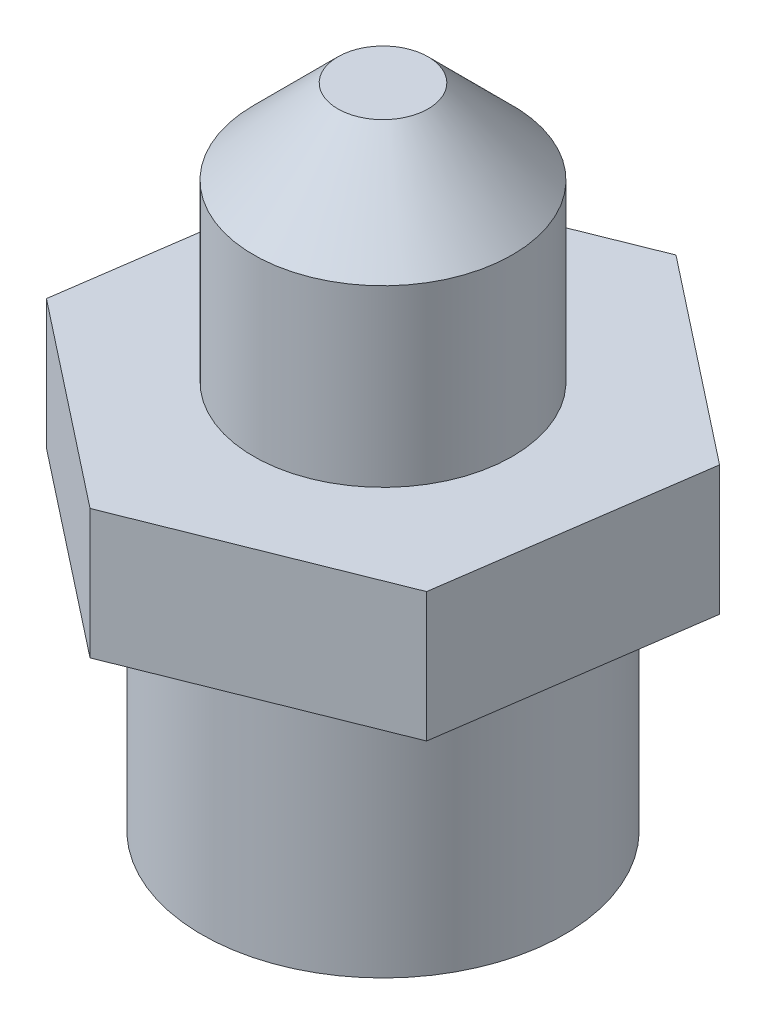
ISO-10303-21;
HEADER;
FILE_DESCRIPTION(('STEP AP214'),'2;1');
FILE_NAME('part.step','',(''),(''),'','','');
FILE_SCHEMA(('AUTOMOTIVE_DESIGN { 1 0 10303 214 1 1 1 1 }'));
ENDSEC;
DATA;
#1=APPLICATION_CONTEXT('core data for automotive mechanical design processes');
#2=APPLICATION_PROTOCOL_DEFINITION('international standard','automotive_design',2000,#1);
#3=PRODUCT_CONTEXT('',#1,'mechanical');
#4=PRODUCT('Part','Part','',(#3));
#5=PRODUCT_RELATED_PRODUCT_CATEGORY('part','',(#4));
#6=PRODUCT_DEFINITION_FORMATION('','',#4);
#7=PRODUCT_DEFINITION_CONTEXT('part definition',#1,'design');
#8=PRODUCT_DEFINITION('design','',#6,#7);
#9=PRODUCT_DEFINITION_SHAPE('','',#8);
#10=(LENGTH_UNIT() NAMED_UNIT(*) SI_UNIT(.MILLI.,.METRE.));
#11=(NAMED_UNIT(*) PLANE_ANGLE_UNIT() SI_UNIT($,.RADIAN.));
#12=(NAMED_UNIT(*) SI_UNIT($,.STERADIAN.) SOLID_ANGLE_UNIT());
#13=UNCERTAINTY_MEASURE_WITH_UNIT(LENGTH_MEASURE(1.E-05),#10,'distance_accuracy_value','');
#14=(GEOMETRIC_REPRESENTATION_CONTEXT(3) GLOBAL_UNCERTAINTY_ASSIGNED_CONTEXT((#13)) GLOBAL_UNIT_ASSIGNED_CONTEXT((#10,
#11,#12)) REPRESENTATION_CONTEXT('',''));
#15=CARTESIAN_POINT('',(0.,0.,0.));
#16=DIRECTION('',(0.,0.,1.));
#17=DIRECTION('',(1.,0.,0.));
#18=AXIS2_PLACEMENT_3D('',#15,#16,#17);
#19=CARTESIAN_POINT('',(10.,15.,0.));
#20=DIRECTION('',(0.,-1.,0.));
#21=DIRECTION('',(1.,0.,0.));
#22=AXIS2_PLACEMENT_3D('',#19,#20,#21);
#23=PLANE('',#22);
#24=CARTESIAN_POINT('',(0.,15.,0.));
#25=DIRECTION('',(0.,1.,0.));
#26=DIRECTION('',(-1.,0.,0.));
#27=AXIS2_PLACEMENT_3D('',#24,#25,#26);
#28=CIRCLE('',#27,5.);
#29=CARTESIAN_POINT('',(-5.,15.,0.));
#30=VERTEX_POINT('',#29);
#31=EDGE_CURVE('E143',#30,#30,#28,.T.);
#32=ORIENTED_EDGE('',*,*,#31,.F.);
#33=EDGE_LOOP('',(#32));
#34=FACE_BOUND('',#33,.T.);
#35=DIRECTION('',(0.928236965949758,0.,-0.371989428672897));
#36=VECTOR('',#35,1.);
#37=CARTESIAN_POINT('',(-1.41966187804891,15.,9.89871507580729));
#38=LINE('',#37,#36);
#39=CARTESIAN_POINT('',(-1.41966187804891,15.,9.89871507580729));
#40=VERTEX_POINT('',#39);
#41=CARTESIAN_POINT('',(7.86270778144867,15.,6.17882078907833));
#42=VERTEX_POINT('',#41);
#43=EDGE_CURVE('E111',#40,#42,#38,.T.);
#44=ORIENTED_EDGE('',*,*,#43,.T.);
#45=DIRECTION('',(0.141966187804891,0.,-0.98987150758073));
#46=VECTOR('',#45,1.);
#47=CARTESIAN_POINT('',(7.86270778144867,15.,6.17882078907833));
#48=LINE('',#47,#46);
#49=CARTESIAN_POINT('',(9.28236965949758,15.,-3.71989428672898));
#50=VERTEX_POINT('',#49);
#51=EDGE_CURVE('E109',#42,#50,#48,.T.);
#52=ORIENTED_EDGE('',*,*,#51,.T.);
#53=DIRECTION('',(-0.786270778144867,0.,-0.617882078907833));
#54=VECTOR('',#53,1.);
#55=CARTESIAN_POINT('',(9.28236965949757,15.,-3.71989428672897));
#56=LINE('',#55,#54);
#57=CARTESIAN_POINT('',(1.41966187804891,15.,-9.89871507580729));
#58=VERTEX_POINT('',#57);
#59=EDGE_CURVE('E59',#50,#58,#56,.T.);
#60=ORIENTED_EDGE('',*,*,#59,.T.);
#61=DIRECTION('',(-0.928236965949758,0.,0.371989428672897));
#62=VECTOR('',#61,1.);
#63=CARTESIAN_POINT('',(1.41966187804891,15.,-9.89871507580729));
#64=LINE('',#63,#62);
#65=CARTESIAN_POINT('',(-7.86270778144866,15.,-6.17882078907833));
#66=VERTEX_POINT('',#65);
#67=EDGE_CURVE('E99',#58,#66,#64,.T.);
#68=ORIENTED_EDGE('',*,*,#67,.T.);
#69=DIRECTION('',(-0.141966187804891,0.,0.98987150758073));
#70=VECTOR('',#69,1.);
#71=CARTESIAN_POINT('',(-7.86270778144866,15.,-6.17882078907833));
#72=LINE('',#71,#70);
#73=CARTESIAN_POINT('',(-9.28236965949757,15.,3.71989428672897));
#74=VERTEX_POINT('',#73);
#75=EDGE_CURVE('E105',#66,#74,#72,.T.);
#76=ORIENTED_EDGE('',*,*,#75,.T.);
#77=DIRECTION('',(0.786270778144867,0.,0.617882078907833));
#78=VECTOR('',#77,1.);
#79=CARTESIAN_POINT('',(-9.28236965949757,15.,3.71989428672897));
#80=LINE('',#79,#78);
#81=EDGE_CURVE('E116',#74,#40,#80,.T.);
#82=ORIENTED_EDGE('',*,*,#81,.T.);
#83=EDGE_LOOP('',(#44,#52,#60,#68,#76,#82));
#84=FACE_BOUND('',#83,.T.);
#85=ADVANCED_FACE('F36',(#34,#84),#23,.F.);
#86=CARTESIAN_POINT('',(0.,25.,0.));
#87=DIRECTION('',(0.,1.,0.));
#88=DIRECTION('',(-1.,0.,0.));
#89=AXIS2_PLACEMENT_3D('',#86,#87,#88);
#90=CYLINDRICAL_SURFACE('',#89,5.);
#91=CARTESIAN_POINT('',(0.,21.7441860465116,0.));
#92=DIRECTION('',(0.,1.,0.));
#93=DIRECTION('',(-1.,0.,0.));
#94=AXIS2_PLACEMENT_3D('',#91,#92,#93);
#95=CIRCLE('',#94,5.);
#96=CARTESIAN_POINT('',(-5.,21.7441860465116,0.));
#97=VERTEX_POINT('',#96);
#98=EDGE_CURVE('E140',#97,#97,#95,.T.);
#99=ORIENTED_EDGE('',*,*,#98,.F.);
#100=EDGE_LOOP('',(#99));
#101=FACE_BOUND('',#100,.T.);
#102=ORIENTED_EDGE('',*,*,#31,.T.);
#103=EDGE_LOOP('',(#102));
#104=FACE_BOUND('',#103,.T.);
#105=ADVANCED_FACE('F163',(#101,#104),#90,.T.);
#106=CARTESIAN_POINT('',(0.,21.7441860465116,0.));
#107=DIRECTION('',(0.,-1.,0.));
#108=DIRECTION('',(1.,0.,0.));
#109=AXIS2_PLACEMENT_3D('',#106,#107,#108);
#110=CONICAL_SURFACE('',#109,5.,0.785398163397449);
#111=CARTESIAN_POINT('',(0.,25.,0.));
#112=DIRECTION('',(0.,1.,0.));
#113=DIRECTION('',(-1.,0.,0.));
#114=AXIS2_PLACEMENT_3D('',#111,#112,#113);
#115=CIRCLE('',#114,1.74418604651164);
#116=CARTESIAN_POINT('',(-1.74418604651164,25.,0.));
#117=VERTEX_POINT('',#116);
#118=EDGE_CURVE('E137',#117,#117,#115,.T.);
#119=ORIENTED_EDGE('',*,*,#118,.F.);
#120=EDGE_LOOP('',(#119));
#121=FACE_BOUND('',#120,.T.);
#122=ORIENTED_EDGE('',*,*,#98,.T.);
#123=EDGE_LOOP('',(#122));
#124=FACE_BOUND('',#123,.T.);
#125=ADVANCED_FACE('F169',(#121,#124),#110,.T.);
#126=CARTESIAN_POINT('',(1.74418604651164,25.,0.));
#127=DIRECTION('',(0.,-1.,0.));
#128=DIRECTION('',(1.,0.,0.));
#129=AXIS2_PLACEMENT_3D('',#126,#127,#128);
#130=PLANE('',#129);
#131=ORIENTED_EDGE('',*,*,#118,.T.);
#132=EDGE_LOOP('',(#131));
#133=FACE_BOUND('',#132,.T.);
#134=ADVANCED_FACE('F200',(#133),#130,.F.);
#135=CARTESIAN_POINT('',(-1.41966187804891,0.,9.89871507580729));
#136=DIRECTION('',(0.371989428672897,0.,0.928236965949758));
#137=DIRECTION('',(0.928236965949758,0.,-0.371989428672897));
#138=AXIS2_PLACEMENT_3D('',#135,#136,#137);
#139=PLANE('',#138);
#140=DIRECTION('',(0.928236965949758,0.,-0.371989428672897));
#141=VECTOR('',#140,1.);
#142=CARTESIAN_POINT('',(9.25289000638916,10.,5.62170756198582));
#143=LINE('',#142,#141);
#144=CARTESIAN_POINT('',(-1.41966187804891,10.,9.89871507580729));
#145=VERTEX_POINT('',#144);
#146=CARTESIAN_POINT('',(7.86270778144866,10.,6.17882078907834));
#147=VERTEX_POINT('',#146);
#148=EDGE_CURVE('E135',#145,#147,#143,.T.);
#149=ORIENTED_EDGE('',*,*,#148,.T.);
#150=DIRECTION('',(0.,1.,0.));
#151=VECTOR('',#150,1.);
#152=CARTESIAN_POINT('',(7.86270778144867,0.,6.17882078907833));
#153=LINE('',#152,#151);
#154=EDGE_CURVE('E51',#147,#42,#153,.T.);
#155=ORIENTED_EDGE('',*,*,#154,.T.);
#156=ORIENTED_EDGE('',*,*,#43,.F.);
#157=DIRECTION('',(0.,1.,0.));
#158=VECTOR('',#157,1.);
#159=CARTESIAN_POINT('',(-1.41966187804891,0.,9.89871507580729));
#160=LINE('',#159,#158);
#161=EDGE_CURVE('E119',#145,#40,#160,.T.);
#162=ORIENTED_EDGE('',*,*,#161,.F.);
#163=EDGE_LOOP('',(#149,#155,#156,#162));
#164=FACE_BOUND('',#163,.T.);
#165=ADVANCED_FACE('F208',(#164),#139,.T.);
#166=CARTESIAN_POINT('',(-9.28236965949757,0.,3.71989428672897));
#167=DIRECTION('',(-0.617882078907833,0.,0.786270778144867));
#168=DIRECTION('',(0.786270778144867,0.,0.617882078907833));
#169=AXIS2_PLACEMENT_3D('',#166,#167,#168);
#170=PLANE('',#169);
#171=DIRECTION('',(0.786270778144867,0.,0.617882078907833));
#172=VECTOR('',#171,1.);
#173=CARTESIAN_POINT('',(-1.0234636128215,10.,10.2100630421605));
#174=LINE('',#173,#172);
#175=CARTESIAN_POINT('',(-9.28236965949757,10.,3.71989428672897));
#176=VERTEX_POINT('',#175);
#177=EDGE_CURVE('E133',#176,#145,#174,.T.);
#178=ORIENTED_EDGE('',*,*,#177,.T.);
#179=ORIENTED_EDGE('',*,*,#161,.T.);
#180=ORIENTED_EDGE('',*,*,#81,.F.);
#181=DIRECTION('',(0.,1.,0.));
#182=VECTOR('',#181,1.);
#183=CARTESIAN_POINT('',(-9.28236965949757,0.,3.71989428672897));
#184=LINE('',#183,#182);
#185=EDGE_CURVE('E122',#176,#74,#184,.T.);
#186=ORIENTED_EDGE('',*,*,#185,.F.);
#187=EDGE_LOOP('',(#178,#179,#180,#186));
#188=FACE_BOUND('',#187,.T.);
#189=ADVANCED_FACE('F223',(#188),#170,.T.);
#190=CARTESIAN_POINT('',(-7.86270778144866,0.,-6.17882078907833));
#191=DIRECTION('',(-0.98987150758073,0.,-0.141966187804891));
#192=DIRECTION('',(-0.141966187804891,0.,0.98987150758073));
#193=AXIS2_PLACEMENT_3D('',#190,#191,#192);
#194=PLANE('',#193);
#195=DIRECTION('',(-0.141966187804891,0.,0.98987150758073));
#196=VECTOR('',#195,1.);
#197=CARTESIAN_POINT('',(-8.43145793111414,10.,-2.2131612416101));
#198=LINE('',#197,#196);
#199=CARTESIAN_POINT('',(-7.86270778144866,10.,-6.17882078907833));
#200=VERTEX_POINT('',#199);
#201=EDGE_CURVE('E131',#200,#176,#198,.T.);
#202=ORIENTED_EDGE('',*,*,#201,.T.);
#203=ORIENTED_EDGE('',*,*,#185,.T.);
#204=ORIENTED_EDGE('',*,*,#75,.F.);
#205=DIRECTION('',(0.,1.,0.));
#206=VECTOR('',#205,1.);
#207=CARTESIAN_POINT('',(-7.86270778144866,0.,-6.17882078907833));
#208=LINE('',#207,#206);
#209=EDGE_CURVE('E95',#200,#66,#208,.T.);
#210=ORIENTED_EDGE('',*,*,#209,.F.);
#211=EDGE_LOOP('',(#202,#203,#204,#210));
#212=FACE_BOUND('',#211,.T.);
#213=ADVANCED_FACE('F233',(#212),#194,.T.);
#214=CARTESIAN_POINT('',(1.41966187804891,0.,-9.89871507580729));
#215=DIRECTION('',(-0.371989428672897,0.,-0.928236965949758));
#216=DIRECTION('',(-0.928236965949758,0.,0.371989428672897));
#217=AXIS2_PLACEMENT_3D('',#214,#215,#216);
#218=PLANE('',#217);
#219=DIRECTION('',(-0.928236965949758,0.,0.371989428672897));
#220=VECTOR('',#219,1.);
#221=CARTESIAN_POINT('',(2.80984410298941,10.,-10.4558283028998));
#222=LINE('',#221,#220);
#223=CARTESIAN_POINT('',(1.41966187804891,10.,-9.89871507580729));
#224=VERTEX_POINT('',#223);
#225=EDGE_CURVE('E129',#224,#200,#222,.T.);
#226=ORIENTED_EDGE('',*,*,#225,.T.);
#227=ORIENTED_EDGE('',*,*,#209,.T.);
#228=ORIENTED_EDGE('',*,*,#67,.F.);
#229=DIRECTION('',(0.,1.,0.));
#230=VECTOR('',#229,1.);
#231=CARTESIAN_POINT('',(1.41966187804891,0.,-9.89871507580729));
#232=LINE('',#231,#230);
#233=EDGE_CURVE('E88',#224,#58,#232,.T.);
#234=ORIENTED_EDGE('',*,*,#233,.F.);
#235=EDGE_LOOP('',(#226,#227,#228,#234));
#236=FACE_BOUND('',#235,.T.);
#237=ADVANCED_FACE('F100',(#236),#218,.T.);
#238=CARTESIAN_POINT('',(9.28236965949757,0.,-3.71989428672897));
#239=DIRECTION('',(0.617882078907833,0.,-0.786270778144867));
#240=DIRECTION('',(-0.786270778144867,0.,-0.617882078907833));
#241=AXIS2_PLACEMENT_3D('',#238,#239,#240);
#242=PLANE('',#241);
#243=DIRECTION('',(-0.786270778144867,0.,-0.617882078907833));
#244=VECTOR('',#243,1.);
#245=CARTESIAN_POINT('',(9.67856792472499,10.,-3.40854632037572));
#246=LINE('',#245,#244);
#247=CARTESIAN_POINT('',(9.28236965949757,10.,-3.71989428672897));
#248=VERTEX_POINT('',#247);
#249=EDGE_CURVE('E92',#248,#224,#246,.T.);
#250=ORIENTED_EDGE('',*,*,#249,.T.);
#251=ORIENTED_EDGE('',*,*,#233,.T.);
#252=ORIENTED_EDGE('',*,*,#59,.F.);
#253=DIRECTION('',(0.,1.,0.));
#254=VECTOR('',#253,1.);
#255=CARTESIAN_POINT('',(9.28236965949757,0.,-3.71989428672897));
#256=LINE('',#255,#254);
#257=EDGE_CURVE('E96',#248,#50,#256,.T.);
#258=ORIENTED_EDGE('',*,*,#257,.F.);
#259=EDGE_LOOP('',(#250,#251,#252,#258));
#260=FACE_BOUND('',#259,.T.);
#261=ADVANCED_FACE('F90',(#260),#242,.T.);
#262=CARTESIAN_POINT('',(7.86270778144867,0.,6.17882078907833));
#263=DIRECTION('',(0.98987150758073,0.,0.141966187804891));
#264=DIRECTION('',(0.141966187804891,0.,-0.98987150758073));
#265=AXIS2_PLACEMENT_3D('',#262,#263,#264);
#266=PLANE('',#265);
#267=DIRECTION('',(0.141966187804891,0.,-0.98987150758073));
#268=VECTOR('',#267,1.);
#269=CARTESIAN_POINT('',(8.7136195098321,10.,0.245765260739265));
#270=LINE('',#269,#268);
#271=EDGE_CURVE('E121',#147,#248,#270,.T.);
#272=ORIENTED_EDGE('',*,*,#271,.T.);
#273=ORIENTED_EDGE('',*,*,#257,.T.);
#274=ORIENTED_EDGE('',*,*,#51,.F.);
#275=ORIENTED_EDGE('',*,*,#154,.F.);
#276=EDGE_LOOP('',(#272,#273,#274,#275));
#277=FACE_BOUND('',#276,.T.);
#278=ADVANCED_FACE('F157',(#277),#266,.T.);
#279=CARTESIAN_POINT('',(0.,0.,0.));
#280=DIRECTION('',(0.,1.,0.));
#281=DIRECTION('',(-1.,0.,0.));
#282=AXIS2_PLACEMENT_3D('',#279,#280,#281);
#283=PLANE('',#282);
#284=CARTESIAN_POINT('',(0.,0.,0.));
#285=DIRECTION('',(0.,1.,0.));
#286=DIRECTION('',(-1.,0.,0.));
#287=AXIS2_PLACEMENT_3D('',#284,#285,#286);
#288=CIRCLE('',#287,7.);
#289=CARTESIAN_POINT('',(-7.,0.,0.));
#290=VERTEX_POINT('',#289);
#291=EDGE_CURVE('E12',#290,#290,#288,.T.);
#292=ORIENTED_EDGE('',*,*,#291,.F.);
#293=EDGE_LOOP('',(#292));
#294=FACE_BOUND('',#293,.T.);
#295=ADVANCED_FACE('F38',(#294),#283,.F.);
#296=CARTESIAN_POINT('',(0.,25.,0.));
#297=DIRECTION('',(0.,1.,0.));
#298=DIRECTION('',(-1.,0.,0.));
#299=AXIS2_PLACEMENT_3D('',#296,#297,#298);
#300=CYLINDRICAL_SURFACE('',#299,7.);
#301=CARTESIAN_POINT('',(0.,10.,0.));
#302=DIRECTION('',(0.,1.,0.));
#303=DIRECTION('',(-1.,0.,0.));
#304=AXIS2_PLACEMENT_3D('',#301,#302,#303);
#305=CIRCLE('',#304,7.);
#306=CARTESIAN_POINT('',(-7.,10.,0.));
#307=VERTEX_POINT('',#306);
#308=EDGE_CURVE('E44',#307,#307,#305,.T.);
#309=ORIENTED_EDGE('',*,*,#308,.F.);
#310=EDGE_LOOP('',(#309));
#311=FACE_BOUND('',#310,.T.);
#312=ORIENTED_EDGE('',*,*,#291,.T.);
#313=EDGE_LOOP('',(#312));
#314=FACE_BOUND('',#313,.T.);
#315=ADVANCED_FACE('F151',(#311,#314),#300,.T.);
#316=CARTESIAN_POINT('',(7.,10.,0.));
#317=DIRECTION('',(0.,1.,0.));
#318=DIRECTION('',(-1.,0.,0.));
#319=AXIS2_PLACEMENT_3D('',#316,#317,#318);
#320=PLANE('',#319);
#321=ORIENTED_EDGE('',*,*,#308,.T.);
#322=EDGE_LOOP('',(#321));
#323=FACE_BOUND('',#322,.T.);
#324=ORIENTED_EDGE('',*,*,#148,.F.);
#325=ORIENTED_EDGE('',*,*,#177,.F.);
#326=ORIENTED_EDGE('',*,*,#201,.F.);
#327=ORIENTED_EDGE('',*,*,#225,.F.);
#328=ORIENTED_EDGE('',*,*,#249,.F.);
#329=ORIENTED_EDGE('',*,*,#271,.F.);
#330=EDGE_LOOP('',(#324,#325,#326,#327,#328,#329));
#331=FACE_BOUND('',#330,.T.);
#332=ADVANCED_FACE('F148',(#323,#331),#320,.F.);
#333=CLOSED_SHELL('',(#85,#105,#125,#134,#165,#189,#213,#237,#261,#278,#295,#315,#332));
#334=MANIFOLD_SOLID_BREP('B2',#333);
#335=ADVANCED_BREP_SHAPE_REPRESENTATION('',(#18,#334),#14);
#336=SHAPE_DEFINITION_REPRESENTATION(#9,#335);
ENDSEC;
END-ISO-10303-21;
